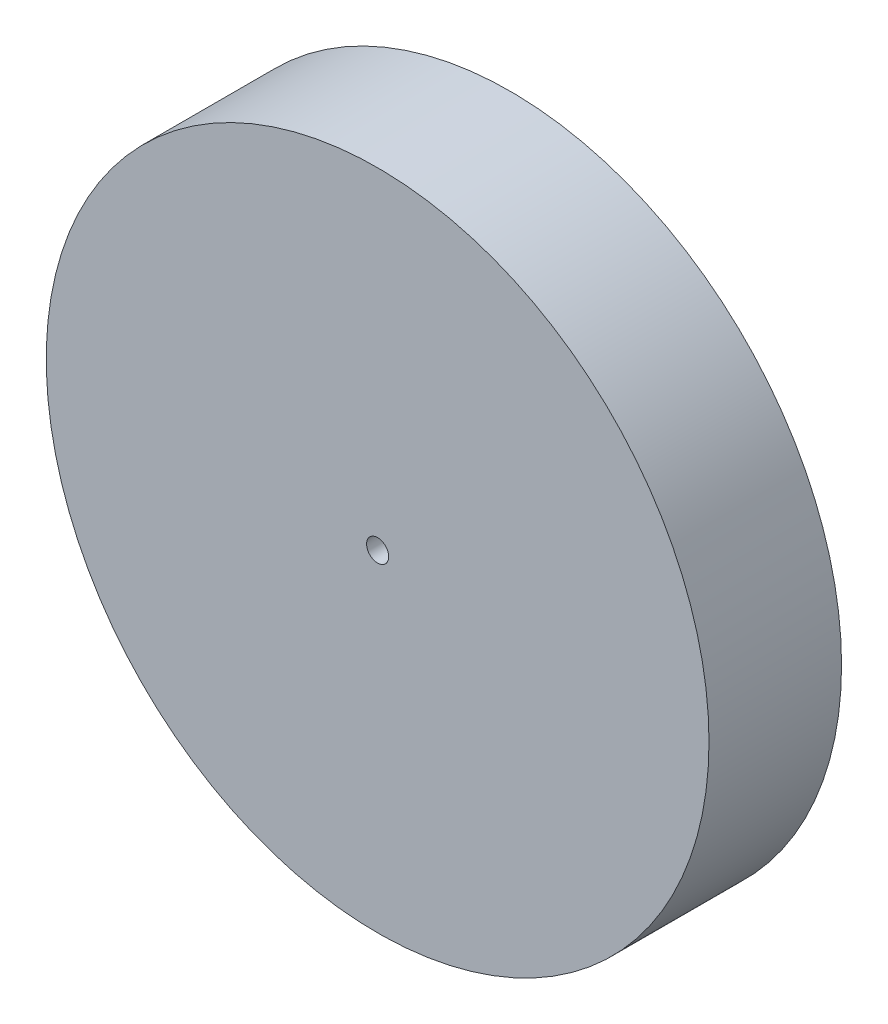
ISO-10303-21;
HEADER;
FILE_DESCRIPTION(('STEP AP214'),'2;1');
FILE_NAME('part.step','',(''),(''),'','','');
FILE_SCHEMA(('AUTOMOTIVE_DESIGN { 1 0 10303 214 1 1 1 1 }'));
ENDSEC;
DATA;
#1=APPLICATION_CONTEXT('core data for automotive mechanical design processes');
#2=APPLICATION_PROTOCOL_DEFINITION('international standard','automotive_design',2000,#1);
#3=PRODUCT_CONTEXT('',#1,'mechanical');
#4=PRODUCT('Part','Part','',(#3));
#5=PRODUCT_RELATED_PRODUCT_CATEGORY('part','',(#4));
#6=PRODUCT_DEFINITION_FORMATION('','',#4);
#7=PRODUCT_DEFINITION_CONTEXT('part definition',#1,'design');
#8=PRODUCT_DEFINITION('design','',#6,#7);
#9=PRODUCT_DEFINITION_SHAPE('','',#8);
#10=(LENGTH_UNIT() NAMED_UNIT(*) SI_UNIT(.MILLI.,.METRE.));
#11=(NAMED_UNIT(*) PLANE_ANGLE_UNIT() SI_UNIT($,.RADIAN.));
#12=(NAMED_UNIT(*) SI_UNIT($,.STERADIAN.) SOLID_ANGLE_UNIT());
#13=UNCERTAINTY_MEASURE_WITH_UNIT(LENGTH_MEASURE(1.E-05),#10,'distance_accuracy_value','');
#14=(GEOMETRIC_REPRESENTATION_CONTEXT(3) GLOBAL_UNCERTAINTY_ASSIGNED_CONTEXT((#13)) GLOBAL_UNIT_ASSIGNED_CONTEXT((#10,
#11,#12)) REPRESENTATION_CONTEXT('',''));
#15=CARTESIAN_POINT('',(0.,0.,0.));
#16=DIRECTION('',(0.,0.,1.));
#17=DIRECTION('',(1.,0.,0.));
#18=AXIS2_PLACEMENT_3D('',#15,#16,#17);
#19=CARTESIAN_POINT('',(0.,0.,0.));
#20=DIRECTION('',(0.,0.,1.));
#21=DIRECTION('',(1.,0.,0.));
#22=AXIS2_PLACEMENT_3D('',#19,#20,#21);
#23=PLANE('',#22);
#24=CARTESIAN_POINT('',(0.,0.,0.));
#25=DIRECTION('',(0.,0.,1.));
#26=DIRECTION('',(1.,0.,0.));
#27=AXIS2_PLACEMENT_3D('',#24,#25,#26);
#28=CIRCLE('',#27,12.5);
#29=CARTESIAN_POINT('',(12.5,0.,0.));
#30=VERTEX_POINT('',#29);
#31=EDGE_CURVE('E64',#30,#30,#28,.F.);
#32=ORIENTED_EDGE('',*,*,#31,.T.);
#33=EDGE_LOOP('',(#32));
#34=FACE_BOUND('',#33,.T.);
#35=CARTESIAN_POINT('',(0.,0.,0.));
#36=DIRECTION('',(0.,0.,-1.));
#37=DIRECTION('',(-1.,0.,0.));
#38=AXIS2_PLACEMENT_3D('',#35,#36,#37);
#39=CIRCLE('',#38,2.5);
#40=CARTESIAN_POINT('',(-2.5,0.,0.));
#41=VERTEX_POINT('',#40);
#42=EDGE_CURVE('E56',#41,#41,#39,.T.);
#43=ORIENTED_EDGE('',*,*,#42,.F.);
#44=EDGE_LOOP('',(#43));
#45=FACE_BOUND('',#44,.T.);
#46=ADVANCED_FACE('F41',(#34,#45),#23,.F.);
#47=CARTESIAN_POINT('',(0.,0.,30.));
#48=DIRECTION('',(0.,0.,-1.));
#49=DIRECTION('',(-1.,0.,0.));
#50=AXIS2_PLACEMENT_3D('',#47,#48,#49);
#51=CYLINDRICAL_SURFACE('',#50,75.);
#52=CARTESIAN_POINT('',(0.,0.,30.));
#53=DIRECTION('',(0.,0.,1.));
#54=DIRECTION('',(1.,0.,0.));
#55=AXIS2_PLACEMENT_3D('',#52,#53,#54);
#56=CIRCLE('',#55,75.);
#57=CARTESIAN_POINT('',(75.,0.,30.));
#58=VERTEX_POINT('',#57);
#59=EDGE_CURVE('E10',#58,#58,#56,.T.);
#60=ORIENTED_EDGE('',*,*,#59,.F.);
#61=EDGE_LOOP('',(#60));
#62=FACE_BOUND('',#61,.T.);
#63=CARTESIAN_POINT('',(0.,0.,0.));
#64=DIRECTION('',(0.,0.,1.));
#65=DIRECTION('',(1.,0.,0.));
#66=AXIS2_PLACEMENT_3D('',#63,#64,#65);
#67=CIRCLE('',#66,75.);
#68=CARTESIAN_POINT('',(75.,0.,0.));
#69=VERTEX_POINT('',#68);
#70=EDGE_CURVE('E45',#69,#69,#67,.T.);
#71=ORIENTED_EDGE('',*,*,#70,.T.);
#72=EDGE_LOOP('',(#71));
#73=FACE_BOUND('',#72,.T.);
#74=ADVANCED_FACE('F43',(#62,#73),#51,.T.);
#75=CARTESIAN_POINT('',(0.,0.,30.));
#76=DIRECTION('',(0.,0.,1.));
#77=DIRECTION('',(1.,0.,0.));
#78=AXIS2_PLACEMENT_3D('',#75,#76,#77);
#79=PLANE('',#78);
#80=CARTESIAN_POINT('',(0.,0.,30.));
#81=DIRECTION('',(0.,0.,-1.));
#82=DIRECTION('',(-1.,0.,0.));
#83=AXIS2_PLACEMENT_3D('',#80,#81,#82);
#84=CIRCLE('',#83,2.5);
#85=CARTESIAN_POINT('',(-2.5,0.,30.));
#86=VERTEX_POINT('',#85);
#87=EDGE_CURVE('E54',#86,#86,#84,.T.);
#88=ORIENTED_EDGE('',*,*,#87,.T.);
#89=EDGE_LOOP('',(#88));
#90=FACE_BOUND('',#89,.T.);
#91=ORIENTED_EDGE('',*,*,#59,.T.);
#92=EDGE_LOOP('',(#91));
#93=FACE_BOUND('',#92,.T.);
#94=ADVANCED_FACE('F103',(#90,#93),#79,.T.);
#95=CARTESIAN_POINT('',(0.,0.,0.));
#96=DIRECTION('',(0.,0.,1.));
#97=DIRECTION('',(1.,0.,0.));
#98=AXIS2_PLACEMENT_3D('',#95,#96,#97);
#99=CIRCLE('',#98,65.);
#100=CARTESIAN_POINT('',(65.,0.,0.));
#101=VERTEX_POINT('',#100);
#102=EDGE_CURVE('E69',#101,#101,#99,.T.);
#103=ORIENTED_EDGE('',*,*,#102,.T.);
#104=EDGE_LOOP('',(#103));
#105=FACE_BOUND('',#104,.T.);
#106=ORIENTED_EDGE('',*,*,#70,.F.);
#107=EDGE_LOOP('',(#106));
#108=FACE_BOUND('',#107,.T.);
#109=ADVANCED_FACE('F99',(#105,#108),#23,.F.);
#110=CARTESIAN_POINT('',(0.,0.,30.));
#111=DIRECTION('',(0.,0.,-1.));
#112=DIRECTION('',(-1.,0.,0.));
#113=AXIS2_PLACEMENT_3D('',#110,#111,#112);
#114=CYLINDRICAL_SURFACE('',#113,2.5);
#115=ORIENTED_EDGE('',*,*,#87,.F.);
#116=EDGE_LOOP('',(#115));
#117=FACE_BOUND('',#116,.T.);
#118=ORIENTED_EDGE('',*,*,#42,.T.);
#119=EDGE_LOOP('',(#118));
#120=FACE_BOUND('',#119,.T.);
#121=ADVANCED_FACE('F94',(#117,#120),#114,.F.);
#122=CARTESIAN_POINT('',(0.,0.,30.));
#123=DIRECTION('',(0.,0.,-1.));
#124=DIRECTION('',(-1.,0.,0.));
#125=AXIS2_PLACEMENT_3D('',#122,#123,#124);
#126=CYLINDRICAL_SURFACE('',#125,65.);
#127=CARTESIAN_POINT('',(0.,0.,20.));
#128=DIRECTION('',(0.,0.,1.));
#129=DIRECTION('',(1.,0.,0.));
#130=AXIS2_PLACEMENT_3D('',#127,#128,#129);
#131=CIRCLE('',#130,65.);
#132=CARTESIAN_POINT('',(65.,0.,20.));
#133=VERTEX_POINT('',#132);
#134=EDGE_CURVE('E60',#133,#133,#131,.T.);
#135=ORIENTED_EDGE('',*,*,#134,.T.);
#136=EDGE_LOOP('',(#135));
#137=FACE_BOUND('',#136,.T.);
#138=ORIENTED_EDGE('',*,*,#102,.F.);
#139=EDGE_LOOP('',(#138));
#140=FACE_BOUND('',#139,.T.);
#141=ADVANCED_FACE('F80',(#137,#140),#126,.F.);
#142=CARTESIAN_POINT('',(0.,0.,20.));
#143=DIRECTION('',(0.,0.,1.));
#144=DIRECTION('',(1.,0.,0.));
#145=AXIS2_PLACEMENT_3D('',#142,#143,#144);
#146=PLANE('',#145);
#147=CARTESIAN_POINT('',(0.,0.,20.));
#148=DIRECTION('',(0.,0.,1.));
#149=DIRECTION('',(1.,0.,0.));
#150=AXIS2_PLACEMENT_3D('',#147,#148,#149);
#151=CIRCLE('',#150,12.5);
#152=CARTESIAN_POINT('',(12.5,0.,20.));
#153=VERTEX_POINT('',#152);
#154=EDGE_CURVE('E68',#153,#153,#151,.F.);
#155=ORIENTED_EDGE('',*,*,#154,.F.);
#156=EDGE_LOOP('',(#155));
#157=FACE_BOUND('',#156,.T.);
#158=ORIENTED_EDGE('',*,*,#134,.F.);
#159=EDGE_LOOP('',(#158));
#160=FACE_BOUND('',#159,.T.);
#161=ADVANCED_FACE('F83',(#157,#160),#146,.F.);
#162=CARTESIAN_POINT('',(0.,0.,30.));
#163=DIRECTION('',(0.,0.,-1.));
#164=DIRECTION('',(-1.,0.,0.));
#165=AXIS2_PLACEMENT_3D('',#162,#163,#164);
#166=CYLINDRICAL_SURFACE('',#165,12.5);
#167=ORIENTED_EDGE('',*,*,#154,.T.);
#168=EDGE_LOOP('',(#167));
#169=FACE_BOUND('',#168,.T.);
#170=ORIENTED_EDGE('',*,*,#31,.F.);
#171=EDGE_LOOP('',(#170));
#172=FACE_BOUND('',#171,.T.);
#173=ADVANCED_FACE('F85',(#169,#172),#166,.T.);
#174=CLOSED_SHELL('',(#46,#74,#94,#109,#121,#141,#161,#173));
#175=MANIFOLD_SOLID_BREP('B2',#174);
#176=ADVANCED_BREP_SHAPE_REPRESENTATION('',(#18,#175),#14);
#177=SHAPE_DEFINITION_REPRESENTATION(#9,#176);
ENDSEC;
END-ISO-10303-21;
